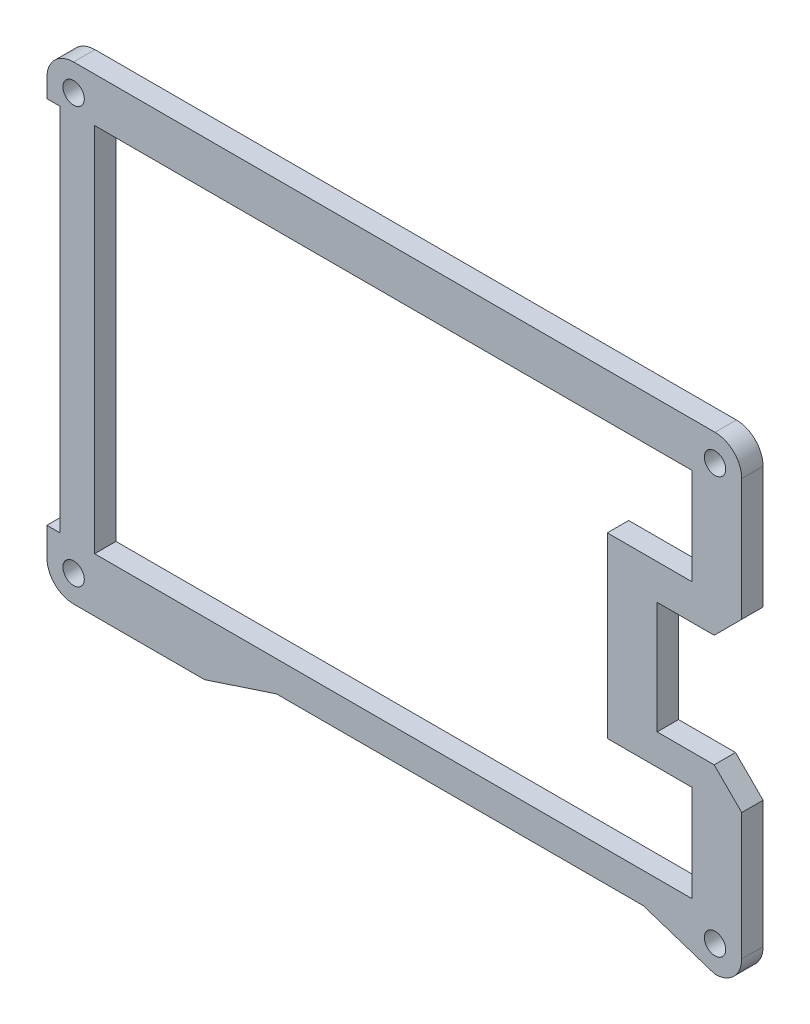
ISO-10303-21;
HEADER;
FILE_DESCRIPTION(('STEP AP214'),'2;1');
FILE_NAME('part.step','',(''),(''),'','','');
FILE_SCHEMA(('AUTOMOTIVE_DESIGN { 1 0 10303 214 1 1 1 1 }'));
ENDSEC;
DATA;
#1=APPLICATION_CONTEXT('core data for automotive mechanical design processes');
#2=APPLICATION_PROTOCOL_DEFINITION('international standard','automotive_design',2000,#1);
#3=PRODUCT_CONTEXT('',#1,'mechanical');
#4=PRODUCT('Part','Part','',(#3));
#5=PRODUCT_RELATED_PRODUCT_CATEGORY('part','',(#4));
#6=PRODUCT_DEFINITION_FORMATION('','',#4);
#7=PRODUCT_DEFINITION_CONTEXT('part definition',#1,'design');
#8=PRODUCT_DEFINITION('design','',#6,#7);
#9=PRODUCT_DEFINITION_SHAPE('','',#8);
#10=(LENGTH_UNIT() NAMED_UNIT(*) SI_UNIT(.MILLI.,.METRE.));
#11=(NAMED_UNIT(*) PLANE_ANGLE_UNIT() SI_UNIT($,.RADIAN.));
#12=(NAMED_UNIT(*) SI_UNIT($,.STERADIAN.) SOLID_ANGLE_UNIT());
#13=UNCERTAINTY_MEASURE_WITH_UNIT(LENGTH_MEASURE(1.E-05),#10,'distance_accuracy_value','');
#14=(GEOMETRIC_REPRESENTATION_CONTEXT(3) GLOBAL_UNCERTAINTY_ASSIGNED_CONTEXT((#13)) GLOBAL_UNIT_ASSIGNED_CONTEXT((#10,
#11,#12)) REPRESENTATION_CONTEXT('',''));
#15=CARTESIAN_POINT('',(0.,0.,0.));
#16=DIRECTION('',(0.,0.,1.));
#17=DIRECTION('',(1.,0.,0.));
#18=AXIS2_PLACEMENT_3D('',#15,#16,#17);
#19=CARTESIAN_POINT('',(-305.7573,91.6317,3.048));
#20=DIRECTION('',(0.,0.,1.));
#21=DIRECTION('',(1.,0.,0.));
#22=AXIS2_PLACEMENT_3D('',#19,#20,#21);
#23=PLANE('',#22);
#24=DIRECTION('',(-1.,0.,0.));
#25=VECTOR('',#24,1.);
#26=CARTESIAN_POINT('',(0.,109.28105,3.048));
#27=LINE('',#26,#25);
#28=CARTESIAN_POINT('',(-309.0593,109.28105,3.048));
#29=VERTEX_POINT('',#28);
#30=CARTESIAN_POINT('',(-321.1243,109.28105,3.048));
#31=VERTEX_POINT('',#30);
#32=EDGE_CURVE('E273',#29,#31,#27,.T.);
#33=ORIENTED_EDGE('',*,*,#32,.F.);
#34=DIRECTION('',(0.,1.,0.));
#35=VECTOR('',#34,1.);
#36=CARTESIAN_POINT('',(-309.0593,109.28105,3.048));
#37=LINE('',#36,#35);
#38=CARTESIAN_POINT('',(-309.0593,95.5317,3.048));
#39=VERTEX_POINT('',#38);
#40=EDGE_CURVE('E253',#39,#29,#37,.T.);
#41=ORIENTED_EDGE('',*,*,#40,.F.);
#42=DIRECTION('',(1.,0.,0.));
#43=VECTOR('',#42,1.);
#44=CARTESIAN_POINT('',(0.,95.5317,3.048));
#45=LINE('',#44,#43);
#46=CARTESIAN_POINT('',(-394.2499,95.5317,3.048));
#47=VERTEX_POINT('',#46);
#48=EDGE_CURVE('E244',#47,#39,#45,.T.);
#49=ORIENTED_EDGE('',*,*,#48,.F.);
#50=DIRECTION('',(0.,-1.,0.));
#51=VECTOR('',#50,1.);
#52=CARTESIAN_POINT('',(-394.2499,0.,3.048));
#53=LINE('',#52,#51);
#54=CARTESIAN_POINT('',(-394.2499,148.4304,3.048));
#55=VERTEX_POINT('',#54);
#56=EDGE_CURVE('E286',#55,#47,#53,.T.);
#57=ORIENTED_EDGE('',*,*,#56,.F.);
#58=DIRECTION('',(1.,0.,0.));
#59=VECTOR('',#58,1.);
#60=CARTESIAN_POINT('',(0.,148.4304,3.048));
#61=LINE('',#60,#59);
#62=CARTESIAN_POINT('',(-309.0593,148.4304,3.048));
#63=VERTEX_POINT('',#62);
#64=EDGE_CURVE('E284',#55,#63,#61,.T.);
#65=ORIENTED_EDGE('',*,*,#64,.T.);
#66=DIRECTION('',(0.,1.,0.));
#67=VECTOR('',#66,1.);
#68=CARTESIAN_POINT('',(-309.0593,148.4304,3.048));
#69=LINE('',#68,#67);
#70=CARTESIAN_POINT('',(-309.0593,134.68105,3.048));
#71=VERTEX_POINT('',#70);
#72=EDGE_CURVE('E257',#71,#63,#69,.T.);
#73=ORIENTED_EDGE('',*,*,#72,.F.);
#74=DIRECTION('',(-1.,0.,0.));
#75=VECTOR('',#74,1.);
#76=CARTESIAN_POINT('',(0.,134.68105,3.048));
#77=LINE('',#76,#75);
#78=CARTESIAN_POINT('',(-321.1243,134.68105,3.048));
#79=VERTEX_POINT('',#78);
#80=EDGE_CURVE('E281',#71,#79,#77,.T.);
#81=ORIENTED_EDGE('',*,*,#80,.T.);
#82=DIRECTION('',(0.,-1.,0.));
#83=VECTOR('',#82,1.);
#84=CARTESIAN_POINT('',(-321.1243,0.,3.048));
#85=LINE('',#84,#83);
#86=EDGE_CURVE('E50',#79,#31,#85,.T.);
#87=ORIENTED_EDGE('',*,*,#86,.T.);
#88=EDGE_LOOP('',(#33,#41,#49,#57,#65,#73,#81,#87));
#89=FACE_BOUND('',#88,.T.);
#90=CARTESIAN_POINT('',(-305.7573,91.6317,3.048));
#91=DIRECTION('',(0.,0.,-1.));
#92=DIRECTION('',(-1.,0.,0.));
#93=AXIS2_PLACEMENT_3D('',#90,#91,#92);
#94=CIRCLE('',#93,1.52400000000001);
#95=CARTESIAN_POINT('',(-307.2813,91.6317,3.048));
#96=VERTEX_POINT('',#95);
#97=EDGE_CURVE('E337',#96,#96,#94,.T.);
#98=ORIENTED_EDGE('',*,*,#97,.T.);
#99=EDGE_LOOP('',(#98));
#100=FACE_BOUND('',#99,.T.);
#101=CARTESIAN_POINT('',(-397.2472,91.6317,3.048));
#102=DIRECTION('',(0.,0.,-1.));
#103=DIRECTION('',(-1.,0.,0.));
#104=AXIS2_PLACEMENT_3D('',#101,#102,#103);
#105=CIRCLE('',#104,1.52400000000001);
#106=CARTESIAN_POINT('',(-398.7712,91.6317,3.048));
#107=VERTEX_POINT('',#106);
#108=EDGE_CURVE('E343',#107,#107,#105,.T.);
#109=ORIENTED_EDGE('',*,*,#108,.T.);
#110=EDGE_LOOP('',(#109));
#111=FACE_BOUND('',#110,.T.);
#112=CARTESIAN_POINT('',(-397.247125,150.9704,3.048));
#113=DIRECTION('',(0.,0.,-1.));
#114=DIRECTION('',(-1.,0.,0.));
#115=AXIS2_PLACEMENT_3D('',#112,#113,#114);
#116=CIRCLE('',#115,1.52400000000001);
#117=CARTESIAN_POINT('',(-398.771125,150.9704,3.048));
#118=VERTEX_POINT('',#117);
#119=EDGE_CURVE('E349',#118,#118,#116,.T.);
#120=ORIENTED_EDGE('',*,*,#119,.T.);
#121=EDGE_LOOP('',(#120));
#122=FACE_BOUND('',#121,.T.);
#123=CARTESIAN_POINT('',(-305.7573,150.9704,3.048));
#124=DIRECTION('',(0.,0.,-1.));
#125=DIRECTION('',(-1.,0.,0.));
#126=AXIS2_PLACEMENT_3D('',#123,#124,#125);
#127=CIRCLE('',#126,1.52400000000001);
#128=CARTESIAN_POINT('',(-307.2813,150.9704,3.048));
#129=VERTEX_POINT('',#128);
#130=EDGE_CURVE('E355',#129,#129,#127,.T.);
#131=ORIENTED_EDGE('',*,*,#130,.T.);
#132=EDGE_LOOP('',(#131));
#133=FACE_BOUND('',#132,.T.);
#134=DIRECTION('',(0.,1.,0.));
#135=VECTOR('',#134,1.);
#136=CARTESIAN_POINT('',(-301.9473,91.6317,3.048));
#137=LINE('',#136,#135);
#138=CARTESIAN_POINT('',(-301.9473,91.6317,3.048));
#139=VERTEX_POINT('',#138);
#140=CARTESIAN_POINT('',(-301.9473,109.71445,3.048));
#141=VERTEX_POINT('',#140);
#142=EDGE_CURVE('E392',#139,#141,#137,.T.);
#143=ORIENTED_EDGE('',*,*,#142,.T.);
#144=DIRECTION('',(0.707106781186548,-0.707106781186548,0.));
#145=VECTOR('',#144,1.);
#146=CARTESIAN_POINT('',(-96.116425,-96.116425,3.048));
#147=LINE('',#146,#145);
#148=CARTESIAN_POINT('',(-305.87795,113.6451,3.048));
#149=VERTEX_POINT('',#148);
#150=EDGE_CURVE('E302',#149,#141,#147,.T.);
#151=ORIENTED_EDGE('',*,*,#150,.F.);
#152=DIRECTION('',(1.,0.,0.));
#153=VECTOR('',#152,1.);
#154=CARTESIAN_POINT('',(0.,113.6451,3.048));
#155=LINE('',#154,#153);
#156=CARTESIAN_POINT('',(-314.0123,113.6451,3.048));
#157=VERTEX_POINT('',#156);
#158=EDGE_CURVE('E317',#157,#149,#155,.T.);
#159=ORIENTED_EDGE('',*,*,#158,.F.);
#160=DIRECTION('',(0.,1.,0.));
#161=VECTOR('',#160,1.);
#162=CARTESIAN_POINT('',(-314.0123,128.8851,3.048));
#163=LINE('',#162,#161);
#164=CARTESIAN_POINT('',(-314.0123,129.6471,3.048));
#165=VERTEX_POINT('',#164);
#166=EDGE_CURVE('E394',#157,#165,#163,.T.);
#167=ORIENTED_EDGE('',*,*,#166,.T.);
#168=DIRECTION('',(-1.,0.,0.));
#169=VECTOR('',#168,1.);
#170=CARTESIAN_POINT('',(0.,129.6471,3.048));
#171=LINE('',#170,#169);
#172=CARTESIAN_POINT('',(-305.87795,129.6471,3.048));
#173=VERTEX_POINT('',#172);
#174=EDGE_CURVE('E314',#173,#165,#171,.T.);
#175=ORIENTED_EDGE('',*,*,#174,.F.);
#176=DIRECTION('',(-0.707106781186548,-0.707106781186548,0.));
#177=VECTOR('',#176,1.);
#178=CARTESIAN_POINT('',(-217.762525,217.762525,3.048));
#179=LINE('',#178,#177);
#180=CARTESIAN_POINT('',(-301.9473,133.57775,3.048));
#181=VERTEX_POINT('',#180);
#182=EDGE_CURVE('E294',#181,#173,#179,.T.);
#183=ORIENTED_EDGE('',*,*,#182,.F.);
#184=DIRECTION('',(0.,1.,0.));
#185=VECTOR('',#184,1.);
#186=CARTESIAN_POINT('',(-301.9473,132.81575,3.048));
#187=LINE('',#186,#185);
#188=CARTESIAN_POINT('',(-301.9473,150.9704,3.048));
#189=VERTEX_POINT('',#188);
#190=EDGE_CURVE('E361',#181,#189,#187,.T.);
#191=ORIENTED_EDGE('',*,*,#190,.T.);
#192=CARTESIAN_POINT('',(-305.7573,150.9704,3.048));
#193=DIRECTION('',(0.,0.,1.));
#194=DIRECTION('',(1.,0.,0.));
#195=AXIS2_PLACEMENT_3D('',#192,#193,#194);
#196=CIRCLE('',#195,3.80999999999997);
#197=CARTESIAN_POINT('',(-305.7573,154.7804,3.048));
#198=VERTEX_POINT('',#197);
#199=EDGE_CURVE('E363',#189,#198,#196,.T.);
#200=ORIENTED_EDGE('',*,*,#199,.T.);
#201=DIRECTION('',(-1.,0.,0.));
#202=VECTOR('',#201,1.);
#203=CARTESIAN_POINT('',(-305.7573,154.7804,3.048));
#204=LINE('',#203,#202);
#205=CARTESIAN_POINT('',(-397.247125,154.7804,3.048));
#206=VERTEX_POINT('',#205);
#207=EDGE_CURVE('E366',#198,#206,#204,.T.);
#208=ORIENTED_EDGE('',*,*,#207,.T.);
#209=CARTESIAN_POINT('',(-397.247125,150.9704,3.048));
#210=DIRECTION('',(0.,0.,1.));
#211=DIRECTION('',(1.,0.,0.));
#212=AXIS2_PLACEMENT_3D('',#209,#210,#211);
#213=CIRCLE('',#212,3.81000000000001);
#214=CARTESIAN_POINT('',(-401.0571,150.956597848903,3.048));
#215=VERTEX_POINT('',#214);
#216=EDGE_CURVE('E368',#206,#215,#213,.T.);
#217=ORIENTED_EDGE('',*,*,#216,.T.);
#218=DIRECTION('',(0.,-1.,0.));
#219=VECTOR('',#218,1.);
#220=CARTESIAN_POINT('',(-401.0571,150.956597848903,3.048));
#221=LINE('',#220,#219);
#222=CARTESIAN_POINT('',(-401.0571,148.341,3.048));
#223=VERTEX_POINT('',#222);
#224=EDGE_CURVE('E370',#215,#223,#221,.T.);
#225=ORIENTED_EDGE('',*,*,#224,.T.);
#226=DIRECTION('',(1.,0.,0.));
#227=VECTOR('',#226,1.);
#228=CARTESIAN_POINT('',(-401.0571,148.341,3.048));
#229=LINE('',#228,#227);
#230=CARTESIAN_POINT('',(-399.1521,148.341,3.048));
#231=VERTEX_POINT('',#230);
#232=EDGE_CURVE('E372',#223,#231,#229,.T.);
#233=ORIENTED_EDGE('',*,*,#232,.T.);
#234=DIRECTION('',(0.,-1.,0.));
#235=VECTOR('',#234,1.);
#236=CARTESIAN_POINT('',(-399.1521,148.341,3.048));
#237=LINE('',#236,#235);
#238=CARTESIAN_POINT('',(-399.1521,95.6449,3.048));
#239=VERTEX_POINT('',#238);
#240=EDGE_CURVE('E374',#231,#239,#237,.T.);
#241=ORIENTED_EDGE('',*,*,#240,.T.);
#242=DIRECTION('',(-1.,0.,0.));
#243=VECTOR('',#242,1.);
#244=CARTESIAN_POINT('',(-399.1521,95.6449,3.048));
#245=LINE('',#244,#243);
#246=CARTESIAN_POINT('',(-401.0571,95.6449,3.048));
#247=VERTEX_POINT('',#246);
#248=EDGE_CURVE('E376',#239,#247,#245,.T.);
#249=ORIENTED_EDGE('',*,*,#248,.T.);
#250=DIRECTION('',(0.,-1.,0.));
#251=VECTOR('',#250,1.);
#252=CARTESIAN_POINT('',(-401.0571,95.6449,3.048));
#253=LINE('',#252,#251);
#254=CARTESIAN_POINT('',(-401.0571,91.6593041663556,3.048));
#255=VERTEX_POINT('',#254);
#256=EDGE_CURVE('E378',#247,#255,#253,.T.);
#257=ORIENTED_EDGE('',*,*,#256,.T.);
#258=CARTESIAN_POINT('',(-397.2472,91.6317,3.048));
#259=DIRECTION('',(0.,0.,1.));
#260=DIRECTION('',(1.,0.,0.));
#261=AXIS2_PLACEMENT_3D('',#258,#259,#260);
#262=CIRCLE('',#261,3.81);
#263=CARTESIAN_POINT('',(-397.2472,87.8217,3.048));
#264=VERTEX_POINT('',#263);
#265=EDGE_CURVE('E380',#255,#264,#262,.T.);
#266=ORIENTED_EDGE('',*,*,#265,.T.);
#267=DIRECTION('',(1.,0.,0.));
#268=VECTOR('',#267,1.);
#269=CARTESIAN_POINT('',(-378.5565,87.8217,3.048));
#270=LINE('',#269,#268);
#271=CARTESIAN_POINT('',(-378.5565,87.8217,3.048));
#272=VERTEX_POINT('',#271);
#273=EDGE_CURVE('E382',#264,#272,#270,.T.);
#274=ORIENTED_EDGE('',*,*,#273,.T.);
#275=DIRECTION('',(0.949975924247208,0.312323139313538,0.));
#276=VECTOR('',#275,1.);
#277=CARTESIAN_POINT('',(-368.3165,91.1883,3.048));
#278=LINE('',#277,#276);
#279=CARTESIAN_POINT('',(-368.3165,91.1883,3.048));
#280=VERTEX_POINT('',#279);
#281=EDGE_CURVE('E384',#272,#280,#278,.T.);
#282=ORIENTED_EDGE('',*,*,#281,.T.);
#283=DIRECTION('',(1.,0.,0.));
#284=VECTOR('',#283,1.);
#285=CARTESIAN_POINT('',(-315.9973,91.1883,3.048));
#286=LINE('',#285,#284);
#287=CARTESIAN_POINT('',(-315.9973,91.1883,3.048));
#288=VERTEX_POINT('',#287);
#289=EDGE_CURVE('E386',#280,#288,#286,.T.);
#290=ORIENTED_EDGE('',*,*,#289,.T.);
#291=DIRECTION('',(0.949975924247207,-0.312323139313541,0.));
#292=VECTOR('',#291,1.);
#293=CARTESIAN_POINT('',(-315.9973,91.1883,3.048));
#294=LINE('',#293,#292);
#295=CARTESIAN_POINT('',(-305.7573,87.8217,3.048));
#296=VERTEX_POINT('',#295);
#297=EDGE_CURVE('E388',#288,#296,#294,.T.);
#298=ORIENTED_EDGE('',*,*,#297,.T.);
#299=CARTESIAN_POINT('',(-305.7573,91.6317,3.048));
#300=DIRECTION('',(0.,0.,1.));
#301=DIRECTION('',(1.,0.,0.));
#302=AXIS2_PLACEMENT_3D('',#299,#300,#301);
#303=CIRCLE('',#302,3.80999999999997);
#304=EDGE_CURVE('E390',#296,#139,#303,.T.);
#305=ORIENTED_EDGE('',*,*,#304,.T.);
#306=EDGE_LOOP('',(#143,#151,#159,#167,#175,#183,#191,#200,#208,#217,#225,#233,#241,#249,#257,
#266,#274,#282,#290,#298,#305));
#307=FACE_BOUND('',#306,.T.);
#308=ADVANCED_FACE('F35',(#89,#100,#111,#122,#133,#307),#23,.T.);
#309=CARTESIAN_POINT('',(-305.7573,91.6317,0.));
#310=DIRECTION('',(0.,0.,1.));
#311=DIRECTION('',(1.,0.,0.));
#312=AXIS2_PLACEMENT_3D('',#309,#310,#311);
#313=PLANE('',#312);
#314=CARTESIAN_POINT('',(-305.7573,91.6317,0.));
#315=DIRECTION('',(0.,0.,-1.));
#316=DIRECTION('',(-1.,0.,0.));
#317=AXIS2_PLACEMENT_3D('',#314,#315,#316);
#318=CIRCLE('',#317,1.52400000000001);
#319=CARTESIAN_POINT('',(-307.2813,91.6317,0.));
#320=VERTEX_POINT('',#319);
#321=EDGE_CURVE('E325',#320,#320,#318,.T.);
#322=ORIENTED_EDGE('',*,*,#321,.F.);
#323=EDGE_LOOP('',(#322));
#324=FACE_BOUND('',#323,.T.);
#325=CARTESIAN_POINT('',(-397.2472,91.6317,0.));
#326=DIRECTION('',(0.,0.,-1.));
#327=DIRECTION('',(-1.,0.,0.));
#328=AXIS2_PLACEMENT_3D('',#325,#326,#327);
#329=CIRCLE('',#328,1.52400000000001);
#330=CARTESIAN_POINT('',(-398.7712,91.6317,0.));
#331=VERTEX_POINT('',#330);
#332=EDGE_CURVE('E340',#331,#331,#329,.T.);
#333=ORIENTED_EDGE('',*,*,#332,.F.);
#334=EDGE_LOOP('',(#333));
#335=FACE_BOUND('',#334,.T.);
#336=CARTESIAN_POINT('',(-397.247125,150.9704,0.));
#337=DIRECTION('',(0.,0.,-1.));
#338=DIRECTION('',(-1.,0.,0.));
#339=AXIS2_PLACEMENT_3D('',#336,#337,#338);
#340=CIRCLE('',#339,1.52400000000001);
#341=CARTESIAN_POINT('',(-398.771125,150.9704,0.));
#342=VERTEX_POINT('',#341);
#343=EDGE_CURVE('E346',#342,#342,#340,.T.);
#344=ORIENTED_EDGE('',*,*,#343,.F.);
#345=EDGE_LOOP('',(#344));
#346=FACE_BOUND('',#345,.T.);
#347=CARTESIAN_POINT('',(-305.7573,150.9704,0.));
#348=DIRECTION('',(0.,0.,-1.));
#349=DIRECTION('',(-1.,0.,0.));
#350=AXIS2_PLACEMENT_3D('',#347,#348,#349);
#351=CIRCLE('',#350,1.52400000000001);
#352=CARTESIAN_POINT('',(-307.2813,150.9704,0.));
#353=VERTEX_POINT('',#352);
#354=EDGE_CURVE('E352',#353,#353,#351,.T.);
#355=ORIENTED_EDGE('',*,*,#354,.F.);
#356=EDGE_LOOP('',(#355));
#357=FACE_BOUND('',#356,.T.);
#358=DIRECTION('',(0.707106781186548,-0.707106781186548,0.));
#359=VECTOR('',#358,1.);
#360=CARTESIAN_POINT('',(-96.116425,-96.116425,0.));
#361=LINE('',#360,#359);
#362=CARTESIAN_POINT('',(-305.87795,113.6451,0.));
#363=VERTEX_POINT('',#362);
#364=CARTESIAN_POINT('',(-301.9473,109.71445,0.));
#365=VERTEX_POINT('',#364);
#366=EDGE_CURVE('E308',#363,#365,#361,.T.);
#367=ORIENTED_EDGE('',*,*,#366,.T.);
#368=DIRECTION('',(0.,1.,0.));
#369=VECTOR('',#368,1.);
#370=CARTESIAN_POINT('',(-301.9473,91.6317,0.));
#371=LINE('',#370,#369);
#372=CARTESIAN_POINT('',(-301.9473,91.6317,0.));
#373=VERTEX_POINT('',#372);
#374=EDGE_CURVE('E426',#373,#365,#371,.T.);
#375=ORIENTED_EDGE('',*,*,#374,.F.);
#376=CARTESIAN_POINT('',(-305.7573,91.6317,0.));
#377=DIRECTION('',(0.,0.,1.));
#378=DIRECTION('',(1.,0.,0.));
#379=AXIS2_PLACEMENT_3D('',#376,#377,#378);
#380=CIRCLE('',#379,3.80999999999997);
#381=CARTESIAN_POINT('',(-305.7573,87.8217,0.));
#382=VERTEX_POINT('',#381);
#383=EDGE_CURVE('E424',#382,#373,#380,.T.);
#384=ORIENTED_EDGE('',*,*,#383,.F.);
#385=DIRECTION('',(0.949975924247207,-0.312323139313541,0.));
#386=VECTOR('',#385,1.);
#387=CARTESIAN_POINT('',(-315.9973,91.1883,0.));
#388=LINE('',#387,#386);
#389=CARTESIAN_POINT('',(-315.9973,91.1883,0.));
#390=VERTEX_POINT('',#389);
#391=EDGE_CURVE('E422',#390,#382,#388,.T.);
#392=ORIENTED_EDGE('',*,*,#391,.F.);
#393=DIRECTION('',(1.,0.,0.));
#394=VECTOR('',#393,1.);
#395=CARTESIAN_POINT('',(-315.9973,91.1883,0.));
#396=LINE('',#395,#394);
#397=CARTESIAN_POINT('',(-368.3165,91.1883,0.));
#398=VERTEX_POINT('',#397);
#399=EDGE_CURVE('E420',#398,#390,#396,.T.);
#400=ORIENTED_EDGE('',*,*,#399,.F.);
#401=DIRECTION('',(0.949975924247208,0.312323139313538,0.));
#402=VECTOR('',#401,1.);
#403=CARTESIAN_POINT('',(-368.3165,91.1883,0.));
#404=LINE('',#403,#402);
#405=CARTESIAN_POINT('',(-378.5565,87.8217,0.));
#406=VERTEX_POINT('',#405);
#407=EDGE_CURVE('E418',#406,#398,#404,.T.);
#408=ORIENTED_EDGE('',*,*,#407,.F.);
#409=DIRECTION('',(1.,0.,0.));
#410=VECTOR('',#409,1.);
#411=CARTESIAN_POINT('',(-378.5565,87.8217,0.));
#412=LINE('',#411,#410);
#413=CARTESIAN_POINT('',(-397.2472,87.8217,0.));
#414=VERTEX_POINT('',#413);
#415=EDGE_CURVE('E416',#414,#406,#412,.T.);
#416=ORIENTED_EDGE('',*,*,#415,.F.);
#417=CARTESIAN_POINT('',(-397.2472,91.6317,0.));
#418=DIRECTION('',(0.,0.,1.));
#419=DIRECTION('',(1.,0.,0.));
#420=AXIS2_PLACEMENT_3D('',#417,#418,#419);
#421=CIRCLE('',#420,3.81);
#422=CARTESIAN_POINT('',(-401.0571,91.6593041663556,0.));
#423=VERTEX_POINT('',#422);
#424=EDGE_CURVE('E414',#423,#414,#421,.T.);
#425=ORIENTED_EDGE('',*,*,#424,.F.);
#426=DIRECTION('',(0.,-1.,0.));
#427=VECTOR('',#426,1.);
#428=CARTESIAN_POINT('',(-401.0571,95.6449,0.));
#429=LINE('',#428,#427);
#430=CARTESIAN_POINT('',(-401.0571,95.6449,0.));
#431=VERTEX_POINT('',#430);
#432=EDGE_CURVE('E412',#431,#423,#429,.T.);
#433=ORIENTED_EDGE('',*,*,#432,.F.);
#434=DIRECTION('',(-1.,0.,0.));
#435=VECTOR('',#434,1.);
#436=CARTESIAN_POINT('',(-399.1521,95.6449,0.));
#437=LINE('',#436,#435);
#438=CARTESIAN_POINT('',(-399.1521,95.6449,0.));
#439=VERTEX_POINT('',#438);
#440=EDGE_CURVE('E410',#439,#431,#437,.T.);
#441=ORIENTED_EDGE('',*,*,#440,.F.);
#442=DIRECTION('',(0.,-1.,0.));
#443=VECTOR('',#442,1.);
#444=CARTESIAN_POINT('',(-399.1521,148.341,0.));
#445=LINE('',#444,#443);
#446=CARTESIAN_POINT('',(-399.1521,148.341,0.));
#447=VERTEX_POINT('',#446);
#448=EDGE_CURVE('E408',#447,#439,#445,.T.);
#449=ORIENTED_EDGE('',*,*,#448,.F.);
#450=DIRECTION('',(1.,0.,0.));
#451=VECTOR('',#450,1.);
#452=CARTESIAN_POINT('',(-401.0571,148.341,0.));
#453=LINE('',#452,#451);
#454=CARTESIAN_POINT('',(-401.0571,148.341,0.));
#455=VERTEX_POINT('',#454);
#456=EDGE_CURVE('E406',#455,#447,#453,.T.);
#457=ORIENTED_EDGE('',*,*,#456,.F.);
#458=DIRECTION('',(0.,-1.,0.));
#459=VECTOR('',#458,1.);
#460=CARTESIAN_POINT('',(-401.0571,150.956597848903,0.));
#461=LINE('',#460,#459);
#462=CARTESIAN_POINT('',(-401.0571,150.956597848903,0.));
#463=VERTEX_POINT('',#462);
#464=EDGE_CURVE('E404',#463,#455,#461,.T.);
#465=ORIENTED_EDGE('',*,*,#464,.F.);
#466=CARTESIAN_POINT('',(-397.247125,150.9704,0.));
#467=DIRECTION('',(0.,0.,1.));
#468=DIRECTION('',(1.,0.,0.));
#469=AXIS2_PLACEMENT_3D('',#466,#467,#468);
#470=CIRCLE('',#469,3.81000000000001);
#471=CARTESIAN_POINT('',(-397.247125,154.7804,0.));
#472=VERTEX_POINT('',#471);
#473=EDGE_CURVE('E402',#472,#463,#470,.T.);
#474=ORIENTED_EDGE('',*,*,#473,.F.);
#475=DIRECTION('',(-1.,0.,0.));
#476=VECTOR('',#475,1.);
#477=CARTESIAN_POINT('',(-305.7573,154.7804,0.));
#478=LINE('',#477,#476);
#479=CARTESIAN_POINT('',(-305.7573,154.7804,0.));
#480=VERTEX_POINT('',#479);
#481=EDGE_CURVE('E400',#480,#472,#478,.T.);
#482=ORIENTED_EDGE('',*,*,#481,.F.);
#483=CARTESIAN_POINT('',(-305.7573,150.9704,0.));
#484=DIRECTION('',(0.,0.,1.));
#485=DIRECTION('',(1.,0.,0.));
#486=AXIS2_PLACEMENT_3D('',#483,#484,#485);
#487=CIRCLE('',#486,3.80999999999997);
#488=CARTESIAN_POINT('',(-301.9473,150.9704,0.));
#489=VERTEX_POINT('',#488);
#490=EDGE_CURVE('E398',#489,#480,#487,.T.);
#491=ORIENTED_EDGE('',*,*,#490,.F.);
#492=DIRECTION('',(0.,1.,0.));
#493=VECTOR('',#492,1.);
#494=CARTESIAN_POINT('',(-301.9473,132.81575,0.));
#495=LINE('',#494,#493);
#496=CARTESIAN_POINT('',(-301.9473,133.57775,0.));
#497=VERTEX_POINT('',#496);
#498=EDGE_CURVE('E358',#497,#489,#495,.T.);
#499=ORIENTED_EDGE('',*,*,#498,.F.);
#500=DIRECTION('',(-0.707106781186548,-0.707106781186548,0.));
#501=VECTOR('',#500,1.);
#502=CARTESIAN_POINT('',(-217.762525,217.762525,0.));
#503=LINE('',#502,#501);
#504=CARTESIAN_POINT('',(-305.87795,129.6471,0.));
#505=VERTEX_POINT('',#504);
#506=EDGE_CURVE('E58',#497,#505,#503,.T.);
#507=ORIENTED_EDGE('',*,*,#506,.T.);
#508=DIRECTION('',(-1.,0.,0.));
#509=VECTOR('',#508,1.);
#510=CARTESIAN_POINT('',(0.,129.6471,0.));
#511=LINE('',#510,#509);
#512=CARTESIAN_POINT('',(-314.0123,129.6471,0.));
#513=VERTEX_POINT('',#512);
#514=EDGE_CURVE('E301',#505,#513,#511,.T.);
#515=ORIENTED_EDGE('',*,*,#514,.T.);
#516=DIRECTION('',(0.,1.,0.));
#517=VECTOR('',#516,1.);
#518=CARTESIAN_POINT('',(-314.0123,128.8851,0.));
#519=LINE('',#518,#517);
#520=CARTESIAN_POINT('',(-314.0123,113.6451,0.));
#521=VERTEX_POINT('',#520);
#522=EDGE_CURVE('E364',#521,#513,#519,.T.);
#523=ORIENTED_EDGE('',*,*,#522,.F.);
#524=DIRECTION('',(1.,0.,0.));
#525=VECTOR('',#524,1.);
#526=CARTESIAN_POINT('',(0.,113.6451,0.));
#527=LINE('',#526,#525);
#528=EDGE_CURVE('E305',#521,#363,#527,.T.);
#529=ORIENTED_EDGE('',*,*,#528,.T.);
#530=EDGE_LOOP('',(#367,#375,#384,#392,#400,#408,#416,#425,#433,#441,#449,#457,#465,#474,#482,
#491,#499,#507,#515,#523,#529));
#531=FACE_BOUND('',#530,.T.);
#532=DIRECTION('',(0.,1.,0.));
#533=VECTOR('',#532,1.);
#534=CARTESIAN_POINT('',(-309.0593,109.28105,0.));
#535=LINE('',#534,#533);
#536=CARTESIAN_POINT('',(-309.0593,95.5317,0.));
#537=VERTEX_POINT('',#536);
#538=CARTESIAN_POINT('',(-309.0593,109.28105,0.));
#539=VERTEX_POINT('',#538);
#540=EDGE_CURVE('E233',#537,#539,#535,.T.);
#541=ORIENTED_EDGE('',*,*,#540,.T.);
#542=DIRECTION('',(-1.,0.,0.));
#543=VECTOR('',#542,1.);
#544=CARTESIAN_POINT('',(0.,109.28105,0.));
#545=LINE('',#544,#543);
#546=CARTESIAN_POINT('',(-321.1243,109.28105,0.));
#547=VERTEX_POINT('',#546);
#548=EDGE_CURVE('E238',#539,#547,#545,.T.);
#549=ORIENTED_EDGE('',*,*,#548,.T.);
#550=DIRECTION('',(0.,-1.,0.));
#551=VECTOR('',#550,1.);
#552=CARTESIAN_POINT('',(-321.1243,0.,0.));
#553=LINE('',#552,#551);
#554=CARTESIAN_POINT('',(-321.1243,134.68105,0.));
#555=VERTEX_POINT('',#554);
#556=EDGE_CURVE('E270',#555,#547,#553,.T.);
#557=ORIENTED_EDGE('',*,*,#556,.F.);
#558=DIRECTION('',(-1.,0.,0.));
#559=VECTOR('',#558,1.);
#560=CARTESIAN_POINT('',(0.,134.68105,0.));
#561=LINE('',#560,#559);
#562=CARTESIAN_POINT('',(-309.0593,134.68105,0.));
#563=VERTEX_POINT('',#562);
#564=EDGE_CURVE('E272',#563,#555,#561,.T.);
#565=ORIENTED_EDGE('',*,*,#564,.F.);
#566=DIRECTION('',(0.,1.,0.));
#567=VECTOR('',#566,1.);
#568=CARTESIAN_POINT('',(-309.0593,148.4304,0.));
#569=LINE('',#568,#567);
#570=CARTESIAN_POINT('',(-309.0593,148.4304,0.));
#571=VERTEX_POINT('',#570);
#572=EDGE_CURVE('E259',#563,#571,#569,.T.);
#573=ORIENTED_EDGE('',*,*,#572,.T.);
#574=DIRECTION('',(1.,0.,0.));
#575=VECTOR('',#574,1.);
#576=CARTESIAN_POINT('',(0.,148.4304,0.));
#577=LINE('',#576,#575);
#578=CARTESIAN_POINT('',(-394.2499,148.4304,0.));
#579=VERTEX_POINT('',#578);
#580=EDGE_CURVE('E275',#579,#571,#577,.T.);
#581=ORIENTED_EDGE('',*,*,#580,.F.);
#582=DIRECTION('',(0.,-1.,0.));
#583=VECTOR('',#582,1.);
#584=CARTESIAN_POINT('',(-394.2499,0.,0.));
#585=LINE('',#584,#583);
#586=CARTESIAN_POINT('',(-394.2499,95.5317,0.));
#587=VERTEX_POINT('',#586);
#588=EDGE_CURVE('E236',#579,#587,#585,.T.);
#589=ORIENTED_EDGE('',*,*,#588,.T.);
#590=DIRECTION('',(1.,0.,0.));
#591=VECTOR('',#590,1.);
#592=CARTESIAN_POINT('',(0.,95.5317,0.));
#593=LINE('',#592,#591);
#594=EDGE_CURVE('E228',#587,#537,#593,.T.);
#595=ORIENTED_EDGE('',*,*,#594,.T.);
#596=EDGE_LOOP('',(#541,#549,#557,#565,#573,#581,#589,#595));
#597=FACE_BOUND('',#596,.T.);
#598=ADVANCED_FACE('F230',(#324,#335,#346,#357,#531,#597),#313,.F.);
#599=CARTESIAN_POINT('',(-301.9473,132.81575,3.048));
#600=DIRECTION('',(-1.,0.,0.));
#601=DIRECTION('',(0.,0.,1.));
#602=AXIS2_PLACEMENT_3D('',#599,#600,#601);
#603=PLANE('',#602);
#604=DIRECTION('',(0.,0.,-1.));
#605=VECTOR('',#604,1.);
#606=CARTESIAN_POINT('',(-301.9473,150.9704,3.048));
#607=LINE('',#606,#605);
#608=EDGE_CURVE('E11',#189,#489,#607,.T.);
#609=ORIENTED_EDGE('',*,*,#608,.F.);
#610=ORIENTED_EDGE('',*,*,#190,.F.);
#611=DIRECTION('',(0.,0.,1.));
#612=VECTOR('',#611,1.);
#613=CARTESIAN_POINT('',(-301.9473,133.57775,0.));
#614=LINE('',#613,#612);
#615=EDGE_CURVE('E311',#497,#181,#614,.T.);
#616=ORIENTED_EDGE('',*,*,#615,.F.);
#617=ORIENTED_EDGE('',*,*,#498,.T.);
#618=EDGE_LOOP('',(#609,#610,#616,#617));
#619=FACE_BOUND('',#618,.T.);
#620=ADVANCED_FACE('F37',(#619),#603,.F.);
#621=CARTESIAN_POINT('',(-305.7573,150.9704,3.048));
#622=DIRECTION('',(0.,0.,-1.));
#623=DIRECTION('',(-1.,0.,0.));
#624=AXIS2_PLACEMENT_3D('',#621,#622,#623);
#625=CYLINDRICAL_SURFACE('',#624,3.80999999999997);
#626=ORIENTED_EDGE('',*,*,#490,.T.);
#627=DIRECTION('',(0.,0.,-1.));
#628=VECTOR('',#627,1.);
#629=CARTESIAN_POINT('',(-305.7573,154.7804,3.048));
#630=LINE('',#629,#628);
#631=EDGE_CURVE('E43',#198,#480,#630,.T.);
#632=ORIENTED_EDGE('',*,*,#631,.F.);
#633=ORIENTED_EDGE('',*,*,#199,.F.);
#634=ORIENTED_EDGE('',*,*,#608,.T.);
#635=EDGE_LOOP('',(#626,#632,#633,#634));
#636=FACE_BOUND('',#635,.T.);
#637=ADVANCED_FACE('F495',(#636),#625,.T.);
#638=CARTESIAN_POINT('',(-305.7573,154.7804,3.048));
#639=DIRECTION('',(0.,-1.,0.));
#640=DIRECTION('',(0.,0.,-1.));
#641=AXIS2_PLACEMENT_3D('',#638,#639,#640);
#642=PLANE('',#641);
#643=ORIENTED_EDGE('',*,*,#481,.T.);
#644=DIRECTION('',(0.,0.,-1.));
#645=VECTOR('',#644,1.);
#646=CARTESIAN_POINT('',(-397.247125,154.7804,3.048));
#647=LINE('',#646,#645);
#648=EDGE_CURVE('E464',#206,#472,#647,.T.);
#649=ORIENTED_EDGE('',*,*,#648,.F.);
#650=ORIENTED_EDGE('',*,*,#207,.F.);
#651=ORIENTED_EDGE('',*,*,#631,.T.);
#652=EDGE_LOOP('',(#643,#649,#650,#651));
#653=FACE_BOUND('',#652,.T.);
#654=ADVANCED_FACE('F471',(#653),#642,.F.);
#655=CARTESIAN_POINT('',(-397.247125,150.9704,3.048));
#656=DIRECTION('',(0.,0.,-1.));
#657=DIRECTION('',(-1.,0.,0.));
#658=AXIS2_PLACEMENT_3D('',#655,#656,#657);
#659=CYLINDRICAL_SURFACE('',#658,3.81000000000001);
#660=ORIENTED_EDGE('',*,*,#473,.T.);
#661=DIRECTION('',(0.,0.,-1.));
#662=VECTOR('',#661,1.);
#663=CARTESIAN_POINT('',(-401.0571,150.956597848903,3.048));
#664=LINE('',#663,#662);
#665=EDGE_CURVE('E461',#215,#463,#664,.T.);
#666=ORIENTED_EDGE('',*,*,#665,.F.);
#667=ORIENTED_EDGE('',*,*,#216,.F.);
#668=ORIENTED_EDGE('',*,*,#648,.T.);
#669=EDGE_LOOP('',(#660,#666,#667,#668));
#670=FACE_BOUND('',#669,.T.);
#671=ADVANCED_FACE('F483',(#670),#659,.T.);
#672=CARTESIAN_POINT('',(-401.0571,150.956597848903,3.048));
#673=DIRECTION('',(1.,0.,0.));
#674=DIRECTION('',(0.,0.,-1.));
#675=AXIS2_PLACEMENT_3D('',#672,#673,#674);
#676=PLANE('',#675);
#677=ORIENTED_EDGE('',*,*,#464,.T.);
#678=DIRECTION('',(0.,0.,-1.));
#679=VECTOR('',#678,1.);
#680=CARTESIAN_POINT('',(-401.0571,148.341,3.048));
#681=LINE('',#680,#679);
#682=EDGE_CURVE('E458',#223,#455,#681,.T.);
#683=ORIENTED_EDGE('',*,*,#682,.F.);
#684=ORIENTED_EDGE('',*,*,#224,.F.);
#685=ORIENTED_EDGE('',*,*,#665,.T.);
#686=EDGE_LOOP('',(#677,#683,#684,#685));
#687=FACE_BOUND('',#686,.T.);
#688=ADVANCED_FACE('F487',(#687),#676,.F.);
#689=CARTESIAN_POINT('',(-401.0571,148.341,3.048));
#690=DIRECTION('',(0.,1.,0.));
#691=DIRECTION('',(0.,0.,1.));
#692=AXIS2_PLACEMENT_3D('',#689,#690,#691);
#693=PLANE('',#692);
#694=ORIENTED_EDGE('',*,*,#456,.T.);
#695=DIRECTION('',(0.,0.,-1.));
#696=VECTOR('',#695,1.);
#697=CARTESIAN_POINT('',(-399.1521,148.341,3.048));
#698=LINE('',#697,#696);
#699=EDGE_CURVE('E455',#231,#447,#698,.T.);
#700=ORIENTED_EDGE('',*,*,#699,.F.);
#701=ORIENTED_EDGE('',*,*,#232,.F.);
#702=ORIENTED_EDGE('',*,*,#682,.T.);
#703=EDGE_LOOP('',(#694,#700,#701,#702));
#704=FACE_BOUND('',#703,.T.);
#705=ADVANCED_FACE('F564',(#704),#693,.F.);
#706=CARTESIAN_POINT('',(-399.1521,148.341,3.048));
#707=DIRECTION('',(1.,0.,0.));
#708=DIRECTION('',(0.,0.,-1.));
#709=AXIS2_PLACEMENT_3D('',#706,#707,#708);
#710=PLANE('',#709);
#711=ORIENTED_EDGE('',*,*,#448,.T.);
#712=DIRECTION('',(0.,0.,-1.));
#713=VECTOR('',#712,1.);
#714=CARTESIAN_POINT('',(-399.1521,95.6449,3.048));
#715=LINE('',#714,#713);
#716=EDGE_CURVE('E452',#239,#439,#715,.T.);
#717=ORIENTED_EDGE('',*,*,#716,.F.);
#718=ORIENTED_EDGE('',*,*,#240,.F.);
#719=ORIENTED_EDGE('',*,*,#699,.T.);
#720=EDGE_LOOP('',(#711,#717,#718,#719));
#721=FACE_BOUND('',#720,.T.);
#722=ADVANCED_FACE('F562',(#721),#710,.F.);
#723=CARTESIAN_POINT('',(-399.1521,95.6449,3.048));
#724=DIRECTION('',(0.,-1.,0.));
#725=DIRECTION('',(0.,0.,-1.));
#726=AXIS2_PLACEMENT_3D('',#723,#724,#725);
#727=PLANE('',#726);
#728=ORIENTED_EDGE('',*,*,#440,.T.);
#729=DIRECTION('',(0.,0.,-1.));
#730=VECTOR('',#729,1.);
#731=CARTESIAN_POINT('',(-401.0571,95.6449,3.048));
#732=LINE('',#731,#730);
#733=EDGE_CURVE('E449',#247,#431,#732,.T.);
#734=ORIENTED_EDGE('',*,*,#733,.F.);
#735=ORIENTED_EDGE('',*,*,#248,.F.);
#736=ORIENTED_EDGE('',*,*,#716,.T.);
#737=EDGE_LOOP('',(#728,#734,#735,#736));
#738=FACE_BOUND('',#737,.T.);
#739=ADVANCED_FACE('F557',(#738),#727,.F.);
#740=CARTESIAN_POINT('',(-401.0571,95.6449,3.048));
#741=DIRECTION('',(1.,0.,0.));
#742=DIRECTION('',(0.,0.,-1.));
#743=AXIS2_PLACEMENT_3D('',#740,#741,#742);
#744=PLANE('',#743);
#745=ORIENTED_EDGE('',*,*,#432,.T.);
#746=DIRECTION('',(0.,0.,-1.));
#747=VECTOR('',#746,1.);
#748=CARTESIAN_POINT('',(-401.0571,91.6593041663556,3.048));
#749=LINE('',#748,#747);
#750=EDGE_CURVE('E446',#255,#423,#749,.T.);
#751=ORIENTED_EDGE('',*,*,#750,.F.);
#752=ORIENTED_EDGE('',*,*,#256,.F.);
#753=ORIENTED_EDGE('',*,*,#733,.T.);
#754=EDGE_LOOP('',(#745,#751,#752,#753));
#755=FACE_BOUND('',#754,.T.);
#756=ADVANCED_FACE('F552',(#755),#744,.F.);
#757=CARTESIAN_POINT('',(-397.2472,91.6317,3.048));
#758=DIRECTION('',(0.,0.,-1.));
#759=DIRECTION('',(-1.,0.,0.));
#760=AXIS2_PLACEMENT_3D('',#757,#758,#759);
#761=CYLINDRICAL_SURFACE('',#760,3.81);
#762=ORIENTED_EDGE('',*,*,#424,.T.);
#763=DIRECTION('',(0.,0.,-1.));
#764=VECTOR('',#763,1.);
#765=CARTESIAN_POINT('',(-397.2472,87.8217,3.048));
#766=LINE('',#765,#764);
#767=EDGE_CURVE('E443',#264,#414,#766,.T.);
#768=ORIENTED_EDGE('',*,*,#767,.F.);
#769=ORIENTED_EDGE('',*,*,#265,.F.);
#770=ORIENTED_EDGE('',*,*,#750,.T.);
#771=EDGE_LOOP('',(#762,#768,#769,#770));
#772=FACE_BOUND('',#771,.T.);
#773=ADVANCED_FACE('F548',(#772),#761,.T.);
#774=CARTESIAN_POINT('',(-378.5565,87.8217,3.048));
#775=DIRECTION('',(0.,1.,0.));
#776=DIRECTION('',(0.,0.,1.));
#777=AXIS2_PLACEMENT_3D('',#774,#775,#776);
#778=PLANE('',#777);
#779=ORIENTED_EDGE('',*,*,#415,.T.);
#780=DIRECTION('',(0.,0.,-1.));
#781=VECTOR('',#780,1.);
#782=CARTESIAN_POINT('',(-378.5565,87.8217,3.048));
#783=LINE('',#782,#781);
#784=EDGE_CURVE('E440',#272,#406,#783,.T.);
#785=ORIENTED_EDGE('',*,*,#784,.F.);
#786=ORIENTED_EDGE('',*,*,#273,.F.);
#787=ORIENTED_EDGE('',*,*,#767,.T.);
#788=EDGE_LOOP('',(#779,#785,#786,#787));
#789=FACE_BOUND('',#788,.T.);
#790=ADVANCED_FACE('F543',(#789),#778,.F.);
#791=CARTESIAN_POINT('',(-368.3165,91.1883,3.048));
#792=DIRECTION('',(-0.312323139313538,0.949975924247208,0.));
#793=DIRECTION('',(-0.949975924247208,-0.312323139313538,0.));
#794=AXIS2_PLACEMENT_3D('',#791,#792,#793);
#795=PLANE('',#794);
#796=ORIENTED_EDGE('',*,*,#407,.T.);
#797=DIRECTION('',(0.,0.,-1.));
#798=VECTOR('',#797,1.);
#799=CARTESIAN_POINT('',(-368.3165,91.1883,3.048));
#800=LINE('',#799,#798);
#801=EDGE_CURVE('E437',#280,#398,#800,.T.);
#802=ORIENTED_EDGE('',*,*,#801,.F.);
#803=ORIENTED_EDGE('',*,*,#281,.F.);
#804=ORIENTED_EDGE('',*,*,#784,.T.);
#805=EDGE_LOOP('',(#796,#802,#803,#804));
#806=FACE_BOUND('',#805,.T.);
#807=ADVANCED_FACE('F537',(#806),#795,.F.);
#808=CARTESIAN_POINT('',(-315.9973,91.1883,3.048));
#809=DIRECTION('',(0.,1.,0.));
#810=DIRECTION('',(-1.,0.,0.));
#811=AXIS2_PLACEMENT_3D('',#808,#809,#810);
#812=PLANE('',#811);
#813=ORIENTED_EDGE('',*,*,#399,.T.);
#814=DIRECTION('',(0.,0.,-1.));
#815=VECTOR('',#814,1.);
#816=CARTESIAN_POINT('',(-315.9973,91.1883,3.048));
#817=LINE('',#816,#815);
#818=EDGE_CURVE('E434',#288,#390,#817,.T.);
#819=ORIENTED_EDGE('',*,*,#818,.F.);
#820=ORIENTED_EDGE('',*,*,#289,.F.);
#821=ORIENTED_EDGE('',*,*,#801,.T.);
#822=EDGE_LOOP('',(#813,#819,#820,#821));
#823=FACE_BOUND('',#822,.T.);
#824=ADVANCED_FACE('F533',(#823),#812,.F.);
#825=CARTESIAN_POINT('',(-315.9973,91.1883,3.048));
#826=DIRECTION('',(0.312323139313541,0.949975924247206,0.));
#827=DIRECTION('',(-0.949975924247207,0.312323139313541,0.));
#828=AXIS2_PLACEMENT_3D('',#825,#826,#827);
#829=PLANE('',#828);
#830=ORIENTED_EDGE('',*,*,#391,.T.);
#831=DIRECTION('',(0.,0.,-1.));
#832=VECTOR('',#831,1.);
#833=CARTESIAN_POINT('',(-305.7573,87.8217,3.048));
#834=LINE('',#833,#832);
#835=EDGE_CURVE('E431',#296,#382,#834,.T.);
#836=ORIENTED_EDGE('',*,*,#835,.F.);
#837=ORIENTED_EDGE('',*,*,#297,.F.);
#838=ORIENTED_EDGE('',*,*,#818,.T.);
#839=EDGE_LOOP('',(#830,#836,#837,#838));
#840=FACE_BOUND('',#839,.T.);
#841=ADVANCED_FACE('F528',(#840),#829,.F.);
#842=CARTESIAN_POINT('',(-305.7573,91.6317,3.048));
#843=DIRECTION('',(0.,0.,-1.));
#844=DIRECTION('',(-1.,0.,0.));
#845=AXIS2_PLACEMENT_3D('',#842,#843,#844);
#846=CYLINDRICAL_SURFACE('',#845,3.80999999999997);
#847=ORIENTED_EDGE('',*,*,#383,.T.);
#848=DIRECTION('',(0.,0.,-1.));
#849=VECTOR('',#848,1.);
#850=CARTESIAN_POINT('',(-301.9473,91.6317,3.048));
#851=LINE('',#850,#849);
#852=EDGE_CURVE('E396',#139,#373,#851,.T.);
#853=ORIENTED_EDGE('',*,*,#852,.F.);
#854=ORIENTED_EDGE('',*,*,#304,.F.);
#855=ORIENTED_EDGE('',*,*,#835,.T.);
#856=EDGE_LOOP('',(#847,#853,#854,#855));
#857=FACE_BOUND('',#856,.T.);
#858=ADVANCED_FACE('F522',(#857),#846,.T.);
#859=CARTESIAN_POINT('',(-301.9473,91.6317,3.048));
#860=DIRECTION('',(-1.,0.,0.));
#861=DIRECTION('',(0.,0.,1.));
#862=AXIS2_PLACEMENT_3D('',#859,#860,#861);
#863=PLANE('',#862);
#864=ORIENTED_EDGE('',*,*,#374,.T.);
#865=DIRECTION('',(0.,0.,1.));
#866=VECTOR('',#865,1.);
#867=CARTESIAN_POINT('',(-301.9473,109.71445,0.));
#868=LINE('',#867,#866);
#869=EDGE_CURVE('E322',#365,#141,#868,.T.);
#870=ORIENTED_EDGE('',*,*,#869,.T.);
#871=ORIENTED_EDGE('',*,*,#142,.F.);
#872=ORIENTED_EDGE('',*,*,#852,.T.);
#873=EDGE_LOOP('',(#864,#870,#871,#872));
#874=FACE_BOUND('',#873,.T.);
#875=ADVANCED_FACE('F518',(#874),#863,.F.);
#876=CARTESIAN_POINT('',(-314.0123,128.8851,3.048));
#877=DIRECTION('',(-1.,0.,0.));
#878=DIRECTION('',(0.,0.,1.));
#879=AXIS2_PLACEMENT_3D('',#876,#877,#878);
#880=PLANE('',#879);
#881=ORIENTED_EDGE('',*,*,#522,.T.);
#882=DIRECTION('',(0.,0.,1.));
#883=VECTOR('',#882,1.);
#884=CARTESIAN_POINT('',(-314.0123,129.6471,0.));
#885=LINE('',#884,#883);
#886=EDGE_CURVE('E331',#513,#165,#885,.T.);
#887=ORIENTED_EDGE('',*,*,#886,.T.);
#888=ORIENTED_EDGE('',*,*,#166,.F.);
#889=DIRECTION('',(0.,0.,1.));
#890=VECTOR('',#889,1.);
#891=CARTESIAN_POINT('',(-314.0123,113.6451,0.));
#892=LINE('',#891,#890);
#893=EDGE_CURVE('E328',#521,#157,#892,.T.);
#894=ORIENTED_EDGE('',*,*,#893,.F.);
#895=EDGE_LOOP('',(#881,#887,#888,#894));
#896=FACE_BOUND('',#895,.T.);
#897=ADVANCED_FACE('F504',(#896),#880,.F.);
#898=CARTESIAN_POINT('',(-305.7573,150.9704,3.048));
#899=DIRECTION('',(0.,0.,-1.));
#900=DIRECTION('',(-1.,0.,0.));
#901=AXIS2_PLACEMENT_3D('',#898,#899,#900);
#902=CYLINDRICAL_SURFACE('',#901,1.52400000000001);
#903=ORIENTED_EDGE('',*,*,#130,.F.);
#904=EDGE_LOOP('',(#903));
#905=FACE_BOUND('',#904,.T.);
#906=ORIENTED_EDGE('',*,*,#354,.T.);
#907=EDGE_LOOP('',(#906));
#908=FACE_BOUND('',#907,.T.);
#909=ADVANCED_FACE('F584',(#905,#908),#902,.F.);
#910=CARTESIAN_POINT('',(-397.247125,150.9704,3.048));
#911=DIRECTION('',(0.,0.,-1.));
#912=DIRECTION('',(-1.,0.,0.));
#913=AXIS2_PLACEMENT_3D('',#910,#911,#912);
#914=CYLINDRICAL_SURFACE('',#913,1.52400000000001);
#915=ORIENTED_EDGE('',*,*,#119,.F.);
#916=EDGE_LOOP('',(#915));
#917=FACE_BOUND('',#916,.T.);
#918=ORIENTED_EDGE('',*,*,#343,.T.);
#919=EDGE_LOOP('',(#918));
#920=FACE_BOUND('',#919,.T.);
#921=ADVANCED_FACE('F656',(#917,#920),#914,.F.);
#922=CARTESIAN_POINT('',(-397.2472,91.6317,3.048));
#923=DIRECTION('',(0.,0.,-1.));
#924=DIRECTION('',(-1.,0.,0.));
#925=AXIS2_PLACEMENT_3D('',#922,#923,#924);
#926=CYLINDRICAL_SURFACE('',#925,1.52400000000001);
#927=ORIENTED_EDGE('',*,*,#108,.F.);
#928=EDGE_LOOP('',(#927));
#929=FACE_BOUND('',#928,.T.);
#930=ORIENTED_EDGE('',*,*,#332,.T.);
#931=EDGE_LOOP('',(#930));
#932=FACE_BOUND('',#931,.T.);
#933=ADVANCED_FACE('F663',(#929,#932),#926,.F.);
#934=CARTESIAN_POINT('',(-305.7573,91.6317,3.048));
#935=DIRECTION('',(0.,0.,-1.));
#936=DIRECTION('',(-1.,0.,0.));
#937=AXIS2_PLACEMENT_3D('',#934,#935,#936);
#938=CYLINDRICAL_SURFACE('',#937,1.52400000000001);
#939=ORIENTED_EDGE('',*,*,#97,.F.);
#940=EDGE_LOOP('',(#939));
#941=FACE_BOUND('',#940,.T.);
#942=ORIENTED_EDGE('',*,*,#321,.T.);
#943=EDGE_LOOP('',(#942));
#944=FACE_BOUND('',#943,.T.);
#945=ADVANCED_FACE('F670',(#941,#944),#938,.F.);
#946=CARTESIAN_POINT('',(-96.116425,-96.116425,0.));
#947=DIRECTION('',(-0.707106781186547,-0.707106781186547,0.));
#948=DIRECTION('',(0.707106781186548,-0.707106781186548,0.));
#949=AXIS2_PLACEMENT_3D('',#946,#947,#948);
#950=PLANE('',#949);
#951=ORIENTED_EDGE('',*,*,#150,.T.);
#952=ORIENTED_EDGE('',*,*,#869,.F.);
#953=ORIENTED_EDGE('',*,*,#366,.F.);
#954=DIRECTION('',(0.,0.,1.));
#955=VECTOR('',#954,1.);
#956=CARTESIAN_POINT('',(-305.87795,113.6451,0.));
#957=LINE('',#956,#955);
#958=EDGE_CURVE('E326',#363,#149,#957,.T.);
#959=ORIENTED_EDGE('',*,*,#958,.T.);
#960=EDGE_LOOP('',(#951,#952,#953,#959));
#961=FACE_BOUND('',#960,.T.);
#962=ADVANCED_FACE('F514',(#961),#950,.F.);
#963=CARTESIAN_POINT('',(0.,113.6451,0.));
#964=DIRECTION('',(0.,-1.,0.));
#965=DIRECTION('',(0.,0.,-1.));
#966=AXIS2_PLACEMENT_3D('',#963,#964,#965);
#967=PLANE('',#966);
#968=ORIENTED_EDGE('',*,*,#158,.T.);
#969=ORIENTED_EDGE('',*,*,#958,.F.);
#970=ORIENTED_EDGE('',*,*,#528,.F.);
#971=ORIENTED_EDGE('',*,*,#893,.T.);
#972=EDGE_LOOP('',(#968,#969,#970,#971));
#973=FACE_BOUND('',#972,.T.);
#974=ADVANCED_FACE('F508',(#973),#967,.F.);
#975=CARTESIAN_POINT('',(0.,129.6471,0.));
#976=DIRECTION('',(0.,1.,0.));
#977=DIRECTION('',(0.,0.,1.));
#978=AXIS2_PLACEMENT_3D('',#975,#976,#977);
#979=PLANE('',#978);
#980=ORIENTED_EDGE('',*,*,#174,.T.);
#981=ORIENTED_EDGE('',*,*,#886,.F.);
#982=ORIENTED_EDGE('',*,*,#514,.F.);
#983=DIRECTION('',(0.,0.,1.));
#984=VECTOR('',#983,1.);
#985=CARTESIAN_POINT('',(-305.87795,129.6471,0.));
#986=LINE('',#985,#984);
#987=EDGE_CURVE('E334',#505,#173,#986,.T.);
#988=ORIENTED_EDGE('',*,*,#987,.T.);
#989=EDGE_LOOP('',(#980,#981,#982,#988));
#990=FACE_BOUND('',#989,.T.);
#991=ADVANCED_FACE('F501',(#990),#979,.F.);
#992=CARTESIAN_POINT('',(-217.762525,217.762525,0.));
#993=DIRECTION('',(-0.707106781186547,0.707106781186547,0.));
#994=DIRECTION('',(-0.707106781186548,-0.707106781186548,0.));
#995=AXIS2_PLACEMENT_3D('',#992,#993,#994);
#996=PLANE('',#995);
#997=ORIENTED_EDGE('',*,*,#182,.T.);
#998=ORIENTED_EDGE('',*,*,#987,.F.);
#999=ORIENTED_EDGE('',*,*,#506,.F.);
#1000=ORIENTED_EDGE('',*,*,#615,.T.);
#1001=EDGE_LOOP('',(#997,#998,#999,#1000));
#1002=FACE_BOUND('',#1001,.T.);
#1003=ADVANCED_FACE('F695',(#1002),#996,.F.);
#1004=CARTESIAN_POINT('',(-321.1243,0.,0.));
#1005=DIRECTION('',(-1.,0.,0.));
#1006=DIRECTION('',(0.,0.,1.));
#1007=AXIS2_PLACEMENT_3D('',#1004,#1005,#1006);
#1008=PLANE('',#1007);
#1009=ORIENTED_EDGE('',*,*,#86,.F.);
#1010=DIRECTION('',(0.,0.,1.));
#1011=VECTOR('',#1010,1.);
#1012=CARTESIAN_POINT('',(-321.1243,134.68105,0.));
#1013=LINE('',#1012,#1011);
#1014=EDGE_CURVE('E279',#555,#79,#1013,.T.);
#1015=ORIENTED_EDGE('',*,*,#1014,.F.);
#1016=ORIENTED_EDGE('',*,*,#556,.T.);
#1017=DIRECTION('',(0.,0.,1.));
#1018=VECTOR('',#1017,1.);
#1019=CARTESIAN_POINT('',(-321.1243,109.28105,0.));
#1020=LINE('',#1019,#1018);
#1021=EDGE_CURVE('E292',#547,#31,#1020,.T.);
#1022=ORIENTED_EDGE('',*,*,#1021,.T.);
#1023=EDGE_LOOP('',(#1009,#1015,#1016,#1022));
#1024=FACE_BOUND('',#1023,.T.);
#1025=ADVANCED_FACE('F702',(#1024),#1008,.T.);
#1026=CARTESIAN_POINT('',(0.,109.28105,0.));
#1027=DIRECTION('',(0.,1.,0.));
#1028=DIRECTION('',(0.,0.,1.));
#1029=AXIS2_PLACEMENT_3D('',#1026,#1027,#1028);
#1030=PLANE('',#1029);
#1031=ORIENTED_EDGE('',*,*,#32,.T.);
#1032=ORIENTED_EDGE('',*,*,#1021,.F.);
#1033=ORIENTED_EDGE('',*,*,#548,.F.);
#1034=DIRECTION('',(0.,0.,1.));
#1035=VECTOR('',#1034,1.);
#1036=CARTESIAN_POINT('',(-309.0593,109.28105,0.));
#1037=LINE('',#1036,#1035);
#1038=EDGE_CURVE('E248',#539,#29,#1037,.T.);
#1039=ORIENTED_EDGE('',*,*,#1038,.T.);
#1040=EDGE_LOOP('',(#1031,#1032,#1033,#1039));
#1041=FACE_BOUND('',#1040,.T.);
#1042=ADVANCED_FACE('F721',(#1041),#1030,.F.);
#1043=CARTESIAN_POINT('',(0.,95.5317,0.));
#1044=DIRECTION('',(0.,-1.,0.));
#1045=DIRECTION('',(0.,0.,-1.));
#1046=AXIS2_PLACEMENT_3D('',#1043,#1044,#1045);
#1047=PLANE('',#1046);
#1048=ORIENTED_EDGE('',*,*,#48,.T.);
#1049=DIRECTION('',(0.,0.,1.));
#1050=VECTOR('',#1049,1.);
#1051=CARTESIAN_POINT('',(-309.0593,95.5317,0.));
#1052=LINE('',#1051,#1050);
#1053=EDGE_CURVE('E241',#537,#39,#1052,.T.);
#1054=ORIENTED_EDGE('',*,*,#1053,.F.);
#1055=ORIENTED_EDGE('',*,*,#594,.F.);
#1056=DIRECTION('',(0.,0.,1.));
#1057=VECTOR('',#1056,1.);
#1058=CARTESIAN_POINT('',(-394.2499,95.5317,0.));
#1059=LINE('',#1058,#1057);
#1060=EDGE_CURVE('E295',#587,#47,#1059,.T.);
#1061=ORIENTED_EDGE('',*,*,#1060,.T.);
#1062=EDGE_LOOP('',(#1048,#1054,#1055,#1061));
#1063=FACE_BOUND('',#1062,.T.);
#1064=ADVANCED_FACE('F242',(#1063),#1047,.F.);
#1065=CARTESIAN_POINT('',(-394.2499,0.,0.));
#1066=DIRECTION('',(-1.,0.,0.));
#1067=DIRECTION('',(0.,0.,1.));
#1068=AXIS2_PLACEMENT_3D('',#1065,#1066,#1067);
#1069=PLANE('',#1068);
#1070=ORIENTED_EDGE('',*,*,#56,.T.);
#1071=ORIENTED_EDGE('',*,*,#1060,.F.);
#1072=ORIENTED_EDGE('',*,*,#588,.F.);
#1073=DIRECTION('',(0.,0.,1.));
#1074=VECTOR('',#1073,1.);
#1075=CARTESIAN_POINT('',(-394.2499,148.4304,0.));
#1076=LINE('',#1075,#1074);
#1077=EDGE_CURVE('E297',#579,#55,#1076,.T.);
#1078=ORIENTED_EDGE('',*,*,#1077,.T.);
#1079=EDGE_LOOP('',(#1070,#1071,#1072,#1078));
#1080=FACE_BOUND('',#1079,.T.);
#1081=ADVANCED_FACE('F725',(#1080),#1069,.F.);
#1082=CARTESIAN_POINT('',(0.,148.4304,0.));
#1083=DIRECTION('',(0.,-1.,0.));
#1084=DIRECTION('',(0.,0.,-1.));
#1085=AXIS2_PLACEMENT_3D('',#1082,#1083,#1084);
#1086=PLANE('',#1085);
#1087=ORIENTED_EDGE('',*,*,#64,.F.);
#1088=ORIENTED_EDGE('',*,*,#1077,.F.);
#1089=ORIENTED_EDGE('',*,*,#580,.T.);
#1090=DIRECTION('',(0.,0.,1.));
#1091=VECTOR('',#1090,1.);
#1092=CARTESIAN_POINT('',(-309.0593,148.4304,0.));
#1093=LINE('',#1092,#1091);
#1094=EDGE_CURVE('E265',#571,#63,#1093,.T.);
#1095=ORIENTED_EDGE('',*,*,#1094,.T.);
#1096=EDGE_LOOP('',(#1087,#1088,#1089,#1095));
#1097=FACE_BOUND('',#1096,.T.);
#1098=ADVANCED_FACE('F728',(#1097),#1086,.T.);
#1099=CARTESIAN_POINT('',(0.,134.68105,0.));
#1100=DIRECTION('',(0.,1.,0.));
#1101=DIRECTION('',(0.,0.,1.));
#1102=AXIS2_PLACEMENT_3D('',#1099,#1100,#1101);
#1103=PLANE('',#1102);
#1104=ORIENTED_EDGE('',*,*,#80,.F.);
#1105=DIRECTION('',(0.,0.,1.));
#1106=VECTOR('',#1105,1.);
#1107=CARTESIAN_POINT('',(-309.0593,134.68105,0.));
#1108=LINE('',#1107,#1106);
#1109=EDGE_CURVE('E262',#563,#71,#1108,.T.);
#1110=ORIENTED_EDGE('',*,*,#1109,.F.);
#1111=ORIENTED_EDGE('',*,*,#564,.T.);
#1112=ORIENTED_EDGE('',*,*,#1014,.T.);
#1113=EDGE_LOOP('',(#1104,#1110,#1111,#1112));
#1114=FACE_BOUND('',#1113,.T.);
#1115=ADVANCED_FACE('F749',(#1114),#1103,.T.);
#1116=CARTESIAN_POINT('',(-309.0593,148.4304,0.));
#1117=DIRECTION('',(1.,0.,0.));
#1118=DIRECTION('',(0.,0.,-1.));
#1119=AXIS2_PLACEMENT_3D('',#1116,#1117,#1118);
#1120=PLANE('',#1119);
#1121=ORIENTED_EDGE('',*,*,#72,.T.);
#1122=ORIENTED_EDGE('',*,*,#1094,.F.);
#1123=ORIENTED_EDGE('',*,*,#572,.F.);
#1124=ORIENTED_EDGE('',*,*,#1109,.T.);
#1125=EDGE_LOOP('',(#1121,#1122,#1123,#1124));
#1126=FACE_BOUND('',#1125,.T.);
#1127=ADVANCED_FACE('F757',(#1126),#1120,.F.);
#1128=CARTESIAN_POINT('',(-309.0593,109.28105,0.));
#1129=DIRECTION('',(1.,0.,0.));
#1130=DIRECTION('',(0.,0.,-1.));
#1131=AXIS2_PLACEMENT_3D('',#1128,#1129,#1130);
#1132=PLANE('',#1131);
#1133=ORIENTED_EDGE('',*,*,#40,.T.);
#1134=ORIENTED_EDGE('',*,*,#1038,.F.);
#1135=ORIENTED_EDGE('',*,*,#540,.F.);
#1136=ORIENTED_EDGE('',*,*,#1053,.T.);
#1137=EDGE_LOOP('',(#1133,#1134,#1135,#1136));
#1138=FACE_BOUND('',#1137,.T.);
#1139=ADVANCED_FACE('F251',(#1138),#1132,.F.);
#1140=CLOSED_SHELL('',(#308,#598,#620,#637,#654,#671,#688,#705,#722,#739,#756,#773,#790,#807,
#824,#841,#858,#875,#897,#909,#921,#933,#945,#962,#974,#991,#1003,#1025,#1042,#1064,#1081,#1098,
#1115,#1127,#1139));
#1141=MANIFOLD_SOLID_BREP('B2',#1140);
#1142=ADVANCED_BREP_SHAPE_REPRESENTATION('',(#18,#1141),#14);
#1143=SHAPE_DEFINITION_REPRESENTATION(#9,#1142);
ENDSEC;
END-ISO-10303-21;
